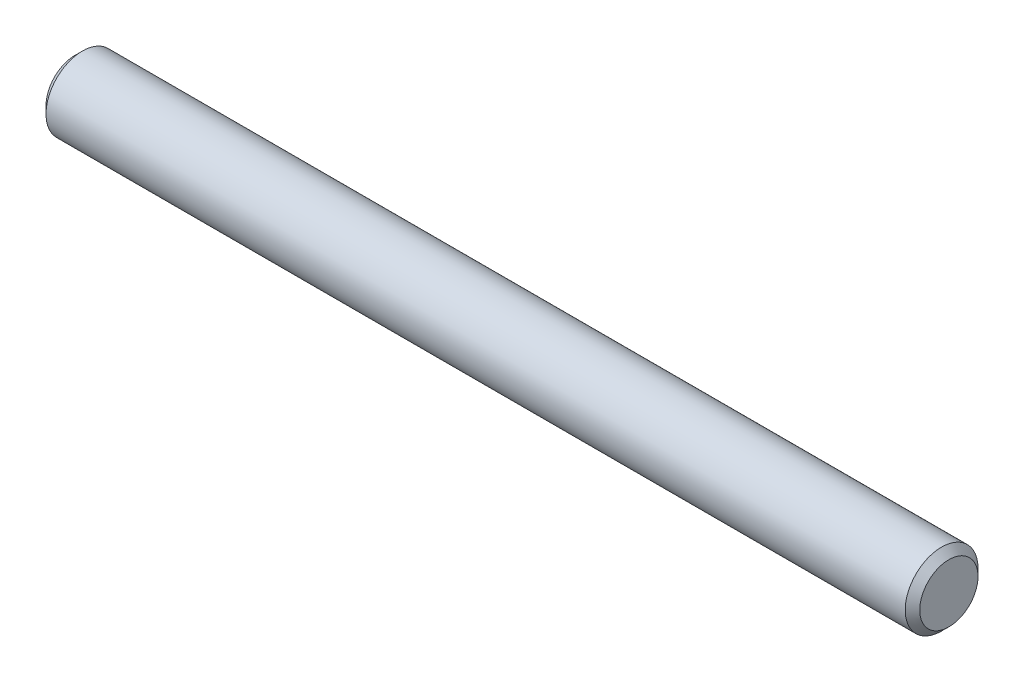
ISO-10303-21;
HEADER;
FILE_DESCRIPTION(('STEP AP214'),'2;1');
FILE_NAME('part.step','',(''),(''),'','','');
FILE_SCHEMA(('AUTOMOTIVE_DESIGN { 1 0 10303 214 1 1 1 1 }'));
ENDSEC;
DATA;
#1=APPLICATION_CONTEXT('core data for automotive mechanical design processes');
#2=APPLICATION_PROTOCOL_DEFINITION('international standard','automotive_design',2000,#1);
#3=PRODUCT_CONTEXT('',#1,'mechanical');
#4=PRODUCT('Part','Part','',(#3));
#5=PRODUCT_RELATED_PRODUCT_CATEGORY('part','',(#4));
#6=PRODUCT_DEFINITION_FORMATION('','',#4);
#7=PRODUCT_DEFINITION_CONTEXT('part definition',#1,'design');
#8=PRODUCT_DEFINITION('design','',#6,#7);
#9=PRODUCT_DEFINITION_SHAPE('','',#8);
#10=(LENGTH_UNIT() NAMED_UNIT(*) SI_UNIT(.MILLI.,.METRE.));
#11=(NAMED_UNIT(*) PLANE_ANGLE_UNIT() SI_UNIT($,.RADIAN.));
#12=(NAMED_UNIT(*) SI_UNIT($,.STERADIAN.) SOLID_ANGLE_UNIT());
#13=UNCERTAINTY_MEASURE_WITH_UNIT(LENGTH_MEASURE(1.E-05),#10,'distance_accuracy_value','');
#14=(GEOMETRIC_REPRESENTATION_CONTEXT(3) GLOBAL_UNCERTAINTY_ASSIGNED_CONTEXT((#13)) GLOBAL_UNIT_ASSIGNED_CONTEXT((#10,
#11,#12)) REPRESENTATION_CONTEXT('',''));
#15=CARTESIAN_POINT('',(0.,0.,0.));
#16=DIRECTION('',(0.,0.,1.));
#17=DIRECTION('',(1.,0.,0.));
#18=AXIS2_PLACEMENT_3D('',#15,#16,#17);
#19=CARTESIAN_POINT('',(-9.52499999999998,0.,0.));
#20=DIRECTION('',(1.,0.,0.));
#21=DIRECTION('',(0.,0.,-0.999999999999998));
#22=AXIS2_PLACEMENT_3D('',#19,#20,#21);
#23=CYLINDRICAL_SURFACE('',#22,0.79375);
#24=CARTESIAN_POINT('',(9.36625000000003,0.,0.));
#25=DIRECTION('',(1.,0.,0.));
#26=DIRECTION('',(0.,0.,-0.999999999999998));
#27=AXIS2_PLACEMENT_3D('',#24,#25,#26);
#28=CIRCLE('',#27,0.79375);
#29=CARTESIAN_POINT('',(9.36625000000003,0.,-0.793750000000012));
#30=VERTEX_POINT('',#29);
#31=EDGE_CURVE('E39',#30,#30,#28,.F.);
#32=ORIENTED_EDGE('',*,*,#31,.T.);
#33=EDGE_LOOP('',(#32));
#34=FACE_BOUND('',#33,.T.);
#35=CARTESIAN_POINT('',(-9.36624999999998,0.,0.));
#36=DIRECTION('',(1.,0.,0.));
#37=DIRECTION('',(0.,0.,-0.999999999999998));
#38=AXIS2_PLACEMENT_3D('',#35,#36,#37);
#39=CIRCLE('',#38,0.79375);
#40=CARTESIAN_POINT('',(-9.36624999999998,0.,-0.793750000000026));
#41=VERTEX_POINT('',#40);
#42=EDGE_CURVE('E43',#41,#41,#39,.T.);
#43=ORIENTED_EDGE('',*,*,#42,.T.);
#44=EDGE_LOOP('',(#43));
#45=FACE_BOUND('',#44,.T.);
#46=ADVANCED_FACE('F32',(#34,#45),#23,.T.);
#47=CARTESIAN_POINT('',(-9.52499999999998,0.,0.));
#48=DIRECTION('',(1.,0.,0.));
#49=DIRECTION('',(0.,0.,-0.999999999999998));
#50=AXIS2_PLACEMENT_3D('',#47,#48,#49);
#51=PLANE('',#50);
#52=CARTESIAN_POINT('',(-9.52499999999998,0.,0.));
#53=DIRECTION('',(1.,0.,0.));
#54=DIRECTION('',(0.,0.,-0.999999999999998));
#55=AXIS2_PLACEMENT_3D('',#52,#53,#54);
#56=CIRCLE('',#55,0.634999999999993);
#57=CARTESIAN_POINT('',(-9.52499999999998,0.,-0.634999999999922));
#58=VERTEX_POINT('',#57);
#59=EDGE_CURVE('E10',#58,#58,#56,.F.);
#60=ORIENTED_EDGE('',*,*,#59,.T.);
#61=EDGE_LOOP('',(#60));
#62=FACE_BOUND('',#61,.T.);
#63=ADVANCED_FACE('F63',(#62),#51,.F.);
#64=CARTESIAN_POINT('',(9.52500000000003,0.,0.));
#65=DIRECTION('',(1.,0.,0.));
#66=DIRECTION('',(0.,0.,-0.999999999999998));
#67=AXIS2_PLACEMENT_3D('',#64,#65,#66);
#68=PLANE('',#67);
#69=CARTESIAN_POINT('',(9.52500000000003,0.,0.));
#70=DIRECTION('',(1.,0.,0.));
#71=DIRECTION('',(0.,0.,-0.999999999999998));
#72=AXIS2_PLACEMENT_3D('',#69,#70,#71);
#73=CIRCLE('',#72,0.635000000000002);
#74=CARTESIAN_POINT('',(9.52500000000003,0.,-0.634999999999973));
#75=VERTEX_POINT('',#74);
#76=EDGE_CURVE('E47',#75,#75,#73,.T.);
#77=ORIENTED_EDGE('',*,*,#76,.T.);
#78=EDGE_LOOP('',(#77));
#79=FACE_BOUND('',#78,.T.);
#80=ADVANCED_FACE('F53',(#79),#68,.T.);
#81=CARTESIAN_POINT('',(9.52499999999994,0.,0.));
#82=DIRECTION('',(-1.,0.,0.));
#83=DIRECTION('',(0.,0.,0.999999999999998));
#84=AXIS2_PLACEMENT_3D('',#81,#82,#83);
#85=CONICAL_SURFACE('',#84,0.635000000000004,0.785398163397462);
#86=ORIENTED_EDGE('',*,*,#31,.F.);
#87=EDGE_LOOP('',(#86));
#88=FACE_BOUND('',#87,.T.);
#89=ORIENTED_EDGE('',*,*,#76,.F.);
#90=EDGE_LOOP('',(#89));
#91=FACE_BOUND('',#90,.T.);
#92=ADVANCED_FACE('F55',(#88,#91),#85,.T.);
#93=CARTESIAN_POINT('',(-9.36624999999998,0.,0.));
#94=DIRECTION('',(1.,0.,0.));
#95=DIRECTION('',(0.,0.,-0.999999999999998));
#96=AXIS2_PLACEMENT_3D('',#93,#94,#95);
#97=CONICAL_SURFACE('',#96,0.79375,0.785398163397445);
#98=ORIENTED_EDGE('',*,*,#59,.F.);
#99=EDGE_LOOP('',(#98));
#100=FACE_BOUND('',#99,.T.);
#101=ORIENTED_EDGE('',*,*,#42,.F.);
#102=EDGE_LOOP('',(#101));
#103=FACE_BOUND('',#102,.T.);
#104=ADVANCED_FACE('F34',(#100,#103),#97,.T.);
#105=CLOSED_SHELL('',(#46,#63,#80,#92,#104));
#106=MANIFOLD_SOLID_BREP('B2',#105);
#107=ADVANCED_BREP_SHAPE_REPRESENTATION('',(#18,#106),#14);
#108=SHAPE_DEFINITION_REPRESENTATION(#9,#107);
ENDSEC;
END-ISO-10303-21;
